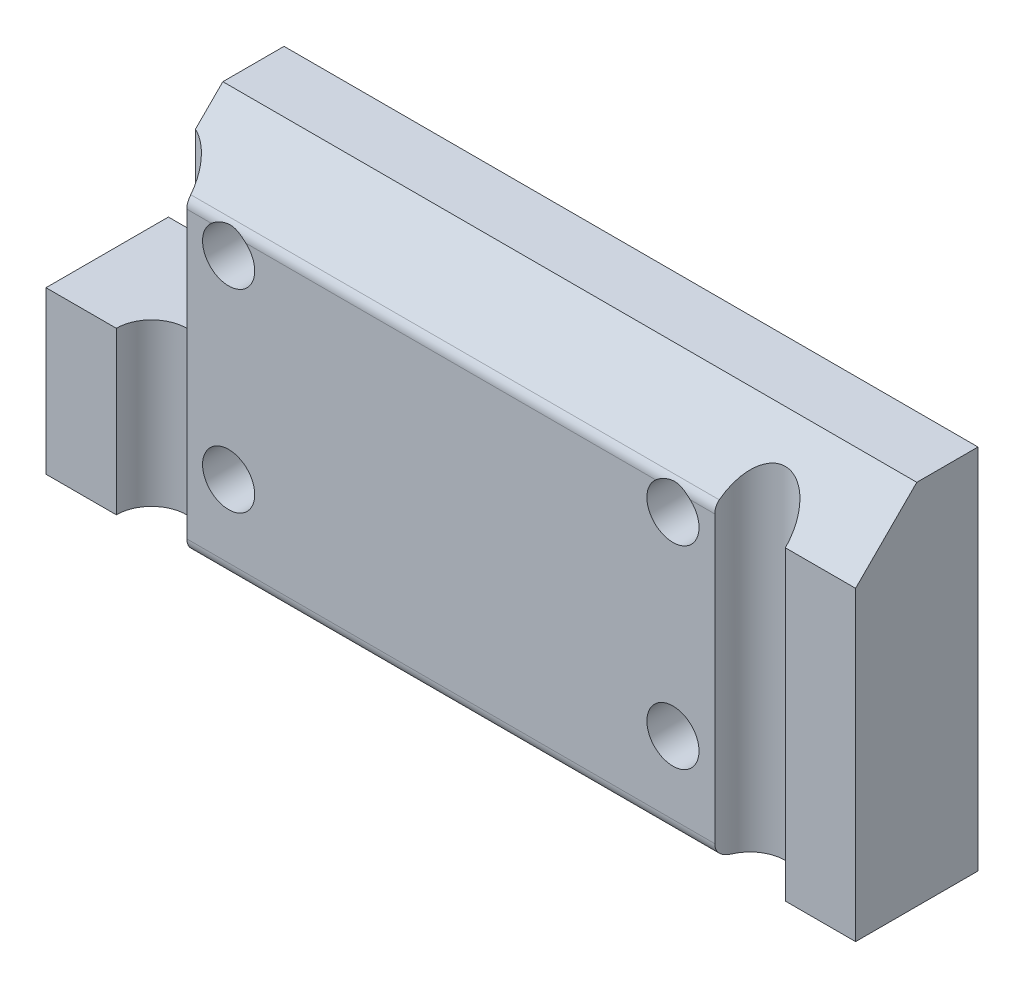
ISO-10303-21;
HEADER;
FILE_DESCRIPTION(('STEP AP214'),'2;1');
FILE_NAME('part.step','',(''),(''),'','','');
FILE_SCHEMA(('AUTOMOTIVE_DESIGN { 1 0 10303 214 1 1 1 1 }'));
ENDSEC;
DATA;
#1=APPLICATION_CONTEXT('core data for automotive mechanical design processes');
#2=APPLICATION_PROTOCOL_DEFINITION('international standard','automotive_design',2000,#1);
#3=PRODUCT_CONTEXT('',#1,'mechanical');
#4=PRODUCT('Part','Part','',(#3));
#5=PRODUCT_RELATED_PRODUCT_CATEGORY('part','',(#4));
#6=PRODUCT_DEFINITION_FORMATION('','',#4);
#7=PRODUCT_DEFINITION_CONTEXT('part definition',#1,'design');
#8=PRODUCT_DEFINITION('design','',#6,#7);
#9=PRODUCT_DEFINITION_SHAPE('','',#8);
#10=(LENGTH_UNIT() NAMED_UNIT(*) SI_UNIT(.MILLI.,.METRE.));
#11=(NAMED_UNIT(*) PLANE_ANGLE_UNIT() SI_UNIT($,.RADIAN.));
#12=(NAMED_UNIT(*) SI_UNIT($,.STERADIAN.) SOLID_ANGLE_UNIT());
#13=UNCERTAINTY_MEASURE_WITH_UNIT(LENGTH_MEASURE(1.E-05),#10,'distance_accuracy_value','');
#14=(GEOMETRIC_REPRESENTATION_CONTEXT(3) GLOBAL_UNCERTAINTY_ASSIGNED_CONTEXT((#13)) GLOBAL_UNIT_ASSIGNED_CONTEXT((#10,
#11,#12)) REPRESENTATION_CONTEXT('',''));
#15=CARTESIAN_POINT('',(0.,0.,0.));
#16=DIRECTION('',(0.,0.,1.));
#17=DIRECTION('',(1.,0.,0.));
#18=AXIS2_PLACEMENT_3D('',#15,#16,#17);
#19=CARTESIAN_POINT('',(21.,6.34999999999997,0.));
#20=DIRECTION('',(0.,0.,-1.));
#21=DIRECTION('',(0.,1.,0.));
#22=AXIS2_PLACEMENT_3D('',#19,#20,#21);
#23=PLANE('',#22);
#24=DIRECTION('',(-1.,0.,0.));
#25=VECTOR('',#24,1.);
#26=CARTESIAN_POINT('',(21.,6.34999999999997,0.));
#27=LINE('',#26,#25);
#28=CARTESIAN_POINT('',(21.,6.34999999999997,0.));
#29=VERTEX_POINT('',#28);
#30=CARTESIAN_POINT('',(17.3538,6.34999999999997,0.));
#31=VERTEX_POINT('',#30);
#32=EDGE_CURVE('E195',#29,#31,#27,.T.);
#33=ORIENTED_EDGE('',*,*,#32,.T.);
#34=DIRECTION('',(0.,-1.,0.));
#35=VECTOR('',#34,1.);
#36=CARTESIAN_POINT('',(17.3538,-9.525,0.));
#37=LINE('',#36,#35);
#38=CARTESIAN_POINT('',(17.3538,-9.525,0.));
#39=VERTEX_POINT('',#38);
#40=EDGE_CURVE('E220',#31,#39,#37,.T.);
#41=ORIENTED_EDGE('',*,*,#40,.T.);
#42=DIRECTION('',(-1.,0.,0.));
#43=VECTOR('',#42,1.);
#44=CARTESIAN_POINT('',(21.,-9.525,0.));
#45=LINE('',#44,#43);
#46=CARTESIAN_POINT('',(21.,-9.525,0.));
#47=VERTEX_POINT('',#46);
#48=EDGE_CURVE('E192',#47,#39,#45,.T.);
#49=ORIENTED_EDGE('',*,*,#48,.F.);
#50=DIRECTION('',(0.,-1.,0.));
#51=VECTOR('',#50,1.);
#52=CARTESIAN_POINT('',(21.,6.34999999999997,0.));
#53=LINE('',#52,#51);
#54=EDGE_CURVE('E300',#29,#47,#53,.T.);
#55=ORIENTED_EDGE('',*,*,#54,.F.);
#56=EDGE_LOOP('',(#33,#41,#49,#55));
#57=FACE_BOUND('',#56,.T.);
#58=ADVANCED_FACE('F45',(#57),#23,.F.);
#59=CARTESIAN_POINT('',(-11.525,-5.025,0.));
#60=DIRECTION('',(0.,0.,-1.));
#61=DIRECTION('',(0.,1.,0.));
#62=AXIS2_PLACEMENT_3D('',#59,#60,#61);
#63=CIRCLE('',#62,1.35255);
#64=CARTESIAN_POINT('',(-11.525,-3.67245,0.));
#65=VERTEX_POINT('',#64);
#66=EDGE_CURVE('E177',#65,#65,#63,.T.);
#67=ORIENTED_EDGE('',*,*,#66,.T.);
#68=EDGE_LOOP('',(#67));
#69=FACE_BOUND('',#68,.T.);
#70=CARTESIAN_POINT('',(11.525,-5.025,0.));
#71=DIRECTION('',(0.,0.,-1.));
#72=DIRECTION('',(0.,1.,0.));
#73=AXIS2_PLACEMENT_3D('',#70,#71,#72);
#74=CIRCLE('',#73,1.35255);
#75=CARTESIAN_POINT('',(11.525,-3.67245,0.));
#76=VERTEX_POINT('',#75);
#77=EDGE_CURVE('E208',#76,#76,#74,.T.);
#78=ORIENTED_EDGE('',*,*,#77,.T.);
#79=EDGE_LOOP('',(#78));
#80=FACE_BOUND('',#79,.T.);
#81=CARTESIAN_POINT('',(11.525,5.025,0.));
#82=DIRECTION('',(0.,0.,-1.));
#83=DIRECTION('',(0.,1.,0.));
#84=AXIS2_PLACEMENT_3D('',#81,#82,#83);
#85=CIRCLE('',#84,1.35255);
#86=CARTESIAN_POINT('',(12.4197101292521,6.03933982822015,0.));
#87=VERTEX_POINT('',#86);
#88=CARTESIAN_POINT('',(10.6302898707479,6.03933982822015,0.));
#89=VERTEX_POINT('',#88);
#90=EDGE_CURVE('E207',#87,#89,#85,.T.);
#91=ORIENTED_EDGE('',*,*,#90,.T.);
#92=DIRECTION('',(-1.,0.,0.));
#93=VECTOR('',#92,1.);
#94=CARTESIAN_POINT('',(21.,6.03933982822015,0.));
#95=LINE('',#94,#93);
#96=CARTESIAN_POINT('',(-10.6302898707479,6.03933982822015,0.));
#97=VERTEX_POINT('',#96);
#98=EDGE_CURVE('E229',#89,#97,#95,.T.);
#99=ORIENTED_EDGE('',*,*,#98,.T.);
#100=CARTESIAN_POINT('',(-11.525,5.025,0.));
#101=DIRECTION('',(0.,0.,-1.));
#102=DIRECTION('',(0.,1.,0.));
#103=AXIS2_PLACEMENT_3D('',#100,#101,#102);
#104=CIRCLE('',#103,1.35255);
#105=CARTESIAN_POINT('',(-12.4197101292521,6.03933982822015,0.));
#106=VERTEX_POINT('',#105);
#107=EDGE_CURVE('E204',#97,#106,#104,.T.);
#108=ORIENTED_EDGE('',*,*,#107,.T.);
#109=DIRECTION('',(-1.,0.,0.));
#110=VECTOR('',#109,1.);
#111=CARTESIAN_POINT('',(-13.0579550646261,6.03933982822015,0.));
#112=LINE('',#111,#110);
#113=CARTESIAN_POINT('',(-13.6962,6.03933982822015,0.));
#114=VERTEX_POINT('',#113);
#115=EDGE_CURVE('E227',#106,#114,#112,.T.);
#116=ORIENTED_EDGE('',*,*,#115,.T.);
#117=DIRECTION('',(0.,-1.,0.));
#118=VECTOR('',#117,1.);
#119=CARTESIAN_POINT('',(-13.6962,-9.525,0.));
#120=LINE('',#119,#118);
#121=CARTESIAN_POINT('',(-13.6962,-8.775,0.));
#122=VERTEX_POINT('',#121);
#123=EDGE_CURVE('E324',#114,#122,#120,.T.);
#124=ORIENTED_EDGE('',*,*,#123,.T.);
#125=DIRECTION('',(-1.,0.,0.));
#126=VECTOR('',#125,1.);
#127=CARTESIAN_POINT('',(21.,-8.775,0.));
#128=LINE('',#127,#126);
#129=CARTESIAN_POINT('',(13.6962,-8.775,0.));
#130=VERTEX_POINT('',#129);
#131=EDGE_CURVE('E223',#122,#130,#128,.F.);
#132=ORIENTED_EDGE('',*,*,#131,.T.);
#133=DIRECTION('',(0.,-1.,0.));
#134=VECTOR('',#133,1.);
#135=CARTESIAN_POINT('',(13.6962,-9.525,0.));
#136=LINE('',#135,#134);
#137=CARTESIAN_POINT('',(13.6962,6.03933982822015,0.));
#138=VERTEX_POINT('',#137);
#139=EDGE_CURVE('E217',#130,#138,#136,.F.);
#140=ORIENTED_EDGE('',*,*,#139,.T.);
#141=DIRECTION('',(-1.,0.,0.));
#142=VECTOR('',#141,1.);
#143=CARTESIAN_POINT('',(13.0579550646261,6.03933982822015,0.));
#144=LINE('',#143,#142);
#145=EDGE_CURVE('E225',#138,#87,#144,.T.);
#146=ORIENTED_EDGE('',*,*,#145,.T.);
#147=EDGE_LOOP('',(#91,#99,#108,#116,#124,#132,#140,#146));
#148=FACE_BOUND('',#147,.T.);
#149=ADVANCED_FACE('F276',(#69,#80,#148),#23,.F.);
#150=CARTESIAN_POINT('',(21.,9.525,-6.35));
#151=DIRECTION('',(0.,0.,1.));
#152=DIRECTION('',(1.,0.,0.));
#153=AXIS2_PLACEMENT_3D('',#150,#151,#152);
#154=PLANE('',#153);
#155=CARTESIAN_POINT('',(11.525,5.025,-6.35));
#156=DIRECTION('',(0.,0.,-1.));
#157=DIRECTION('',(-1.,0.,0.));
#158=AXIS2_PLACEMENT_3D('',#155,#156,#157);
#159=CIRCLE('',#158,1.35255);
#160=CARTESIAN_POINT('',(10.17245,5.025,-6.35));
#161=VERTEX_POINT('',#160);
#162=EDGE_CURVE('E327',#161,#161,#159,.T.);
#163=ORIENTED_EDGE('',*,*,#162,.F.);
#164=EDGE_LOOP('',(#163));
#165=FACE_BOUND('',#164,.T.);
#166=CARTESIAN_POINT('',(11.525,-5.025,-6.35));
#167=DIRECTION('',(0.,0.,-1.));
#168=DIRECTION('',(-1.,0.,0.));
#169=AXIS2_PLACEMENT_3D('',#166,#167,#168);
#170=CIRCLE('',#169,1.35255);
#171=CARTESIAN_POINT('',(10.17245,-5.025,-6.35));
#172=VERTEX_POINT('',#171);
#173=EDGE_CURVE('E212',#172,#172,#170,.T.);
#174=ORIENTED_EDGE('',*,*,#173,.F.);
#175=EDGE_LOOP('',(#174));
#176=FACE_BOUND('',#175,.T.);
#177=CARTESIAN_POINT('',(-11.525,5.025,-6.35));
#178=DIRECTION('',(0.,0.,-1.));
#179=DIRECTION('',(-1.,0.,0.));
#180=AXIS2_PLACEMENT_3D('',#177,#178,#179);
#181=CIRCLE('',#180,1.35255);
#182=CARTESIAN_POINT('',(-12.87755,5.025,-6.35));
#183=VERTEX_POINT('',#182);
#184=EDGE_CURVE('E211',#183,#183,#181,.T.);
#185=ORIENTED_EDGE('',*,*,#184,.F.);
#186=EDGE_LOOP('',(#185));
#187=FACE_BOUND('',#186,.T.);
#188=CARTESIAN_POINT('',(-11.525,-5.025,-6.35));
#189=DIRECTION('',(0.,0.,-1.));
#190=DIRECTION('',(-1.,0.,0.));
#191=AXIS2_PLACEMENT_3D('',#188,#189,#190);
#192=CIRCLE('',#191,1.35255);
#193=CARTESIAN_POINT('',(-12.87755,-5.025,-6.35));
#194=VERTEX_POINT('',#193);
#195=EDGE_CURVE('E182',#194,#194,#192,.T.);
#196=ORIENTED_EDGE('',*,*,#195,.F.);
#197=EDGE_LOOP('',(#196));
#198=FACE_BOUND('',#197,.T.);
#199=DIRECTION('',(1.,0.,0.));
#200=VECTOR('',#199,1.);
#201=CARTESIAN_POINT('',(-21.,-1.143,-6.35));
#202=LINE('',#201,#200);
#203=CARTESIAN_POINT('',(-21.,-1.143,-6.35));
#204=VERTEX_POINT('',#203);
#205=CARTESIAN_POINT('',(-15.,-1.143,-6.35));
#206=VERTEX_POINT('',#205);
#207=EDGE_CURVE('E152',#204,#206,#202,.T.);
#208=ORIENTED_EDGE('',*,*,#207,.T.);
#209=DIRECTION('',(0.,1.,0.));
#210=VECTOR('',#209,1.);
#211=CARTESIAN_POINT('',(-15.,9.525,-6.35));
#212=LINE('',#211,#210);
#213=CARTESIAN_POINT('',(-15.,9.525,-6.35));
#214=VERTEX_POINT('',#213);
#215=EDGE_CURVE('E162',#206,#214,#212,.T.);
#216=ORIENTED_EDGE('',*,*,#215,.T.);
#217=DIRECTION('',(-1.,0.,0.));
#218=VECTOR('',#217,1.);
#219=CARTESIAN_POINT('',(21.,9.525,-6.35));
#220=LINE('',#219,#218);
#221=CARTESIAN_POINT('',(21.,9.525,-6.35));
#222=VERTEX_POINT('',#221);
#223=EDGE_CURVE('E201',#222,#214,#220,.T.);
#224=ORIENTED_EDGE('',*,*,#223,.F.);
#225=DIRECTION('',(0.,1.,0.));
#226=VECTOR('',#225,1.);
#227=CARTESIAN_POINT('',(21.,9.525,-6.35));
#228=LINE('',#227,#226);
#229=CARTESIAN_POINT('',(21.,-9.525,-6.35));
#230=VERTEX_POINT('',#229);
#231=EDGE_CURVE('E189',#230,#222,#228,.T.);
#232=ORIENTED_EDGE('',*,*,#231,.F.);
#233=DIRECTION('',(-1.,0.,0.));
#234=VECTOR('',#233,1.);
#235=CARTESIAN_POINT('',(21.,-9.525,-6.35));
#236=LINE('',#235,#234);
#237=CARTESIAN_POINT('',(-21.,-9.525,-6.35));
#238=VERTEX_POINT('',#237);
#239=EDGE_CURVE('E176',#230,#238,#236,.T.);
#240=ORIENTED_EDGE('',*,*,#239,.T.);
#241=DIRECTION('',(0.,1.,0.));
#242=VECTOR('',#241,1.);
#243=CARTESIAN_POINT('',(-21.,9.525,-6.35));
#244=LINE('',#243,#242);
#245=EDGE_CURVE('E169',#238,#204,#244,.T.);
#246=ORIENTED_EDGE('',*,*,#245,.T.);
#247=EDGE_LOOP('',(#208,#216,#224,#232,#240,#246));
#248=FACE_BOUND('',#247,.T.);
#249=ADVANCED_FACE('F173',(#165,#176,#187,#198,#248),#154,.F.);
#250=CARTESIAN_POINT('',(21.,9.525,-3.175));
#251=DIRECTION('',(0.,-1.,0.));
#252=DIRECTION('',(0.,0.,-1.));
#253=AXIS2_PLACEMENT_3D('',#250,#251,#252);
#254=PLANE('',#253);
#255=ORIENTED_EDGE('',*,*,#223,.T.);
#256=DIRECTION('',(0.,0.,1.));
#257=VECTOR('',#256,1.);
#258=CARTESIAN_POINT('',(-15.,9.525,-6.35));
#259=LINE('',#258,#257);
#260=CARTESIAN_POINT('',(-15.,9.525,-3.175));
#261=VERTEX_POINT('',#260);
#262=EDGE_CURVE('E317',#214,#261,#259,.T.);
#263=ORIENTED_EDGE('',*,*,#262,.T.);
#264=DIRECTION('',(-1.,0.,0.));
#265=VECTOR('',#264,1.);
#266=CARTESIAN_POINT('',(21.,9.525,-3.175));
#267=LINE('',#266,#265);
#268=CARTESIAN_POINT('',(21.,9.525,-3.175));
#269=VERTEX_POINT('',#268);
#270=EDGE_CURVE('E198',#269,#261,#267,.T.);
#271=ORIENTED_EDGE('',*,*,#270,.F.);
#272=DIRECTION('',(0.,0.,1.));
#273=VECTOR('',#272,1.);
#274=CARTESIAN_POINT('',(21.,9.525,-3.175));
#275=LINE('',#274,#273);
#276=EDGE_CURVE('E338',#222,#269,#275,.T.);
#277=ORIENTED_EDGE('',*,*,#276,.F.);
#278=EDGE_LOOP('',(#255,#263,#271,#277));
#279=FACE_BOUND('',#278,.T.);
#280=ADVANCED_FACE('F279',(#279),#254,.F.);
#281=CARTESIAN_POINT('',(21.,6.34999999999997,0.));
#282=DIRECTION('',(0.,-0.707106781186544,-0.707106781186551));
#283=DIRECTION('',(0.,0.707106781186551,-0.707106781186544));
#284=AXIS2_PLACEMENT_3D('',#281,#282,#283);
#285=PLANE('',#284);
#286=ORIENTED_EDGE('',*,*,#270,.T.);
#287=DIRECTION('',(0.,-0.707106781186551,0.707106781186544));
#288=VECTOR('',#287,1.);
#289=CARTESIAN_POINT('',(-15.,6.34999999999996,0.));
#290=LINE('',#289,#288);
#291=CARTESIAN_POINT('',(-15.,8.10182317600833,-1.75182317600835));
#292=VERTEX_POINT('',#291);
#293=EDGE_CURVE('E314',#261,#292,#290,.T.);
#294=ORIENTED_EDGE('',*,*,#293,.T.);
#295=CARTESIAN_POINT('',(-15.525,6.34999999999997,0.));
#296=DIRECTION('',(0.,-0.707106781186544,-0.707106781186551));
#297=DIRECTION('',(0.,-0.707106781186551,0.707106781186544));
#298=AXIS2_PLACEMENT_3D('',#295,#296,#297);
#299=ELLIPSE('',#298,2.58631376286792,1.82879999999999);
#300=CARTESIAN_POINT('',(-13.7094409762184,6.56966991411005,-0.219669914110086));
#301=VERTEX_POINT('',#300);
#302=EDGE_CURVE('E322',#292,#301,#299,.T.);
#303=ORIENTED_EDGE('',*,*,#302,.T.);
#304=DIRECTION('',(-1.,0.,0.));
#305=VECTOR('',#304,1.);
#306=CARTESIAN_POINT('',(21.,6.56966991411005,-0.219669914110086));
#307=LINE('',#306,#305);
#308=CARTESIAN_POINT('',(13.7094409762184,6.56966991411005,-0.219669914110086));
#309=VERTEX_POINT('',#308);
#310=EDGE_CURVE('E306',#301,#309,#307,.F.);
#311=ORIENTED_EDGE('',*,*,#310,.T.);
#312=CARTESIAN_POINT('',(15.525,6.34999999999997,0.));
#313=DIRECTION('',(0.,-0.707106781186544,-0.707106781186551));
#314=DIRECTION('',(0.,-0.707106781186551,0.707106781186544));
#315=AXIS2_PLACEMENT_3D('',#312,#313,#314);
#316=ELLIPSE('',#315,2.58631376286792,1.82879999999999);
#317=EDGE_CURVE('E304',#309,#31,#316,.T.);
#318=ORIENTED_EDGE('',*,*,#317,.T.);
#319=ORIENTED_EDGE('',*,*,#32,.F.);
#320=DIRECTION('',(0.,-0.707106781186551,0.707106781186544));
#321=VECTOR('',#320,1.);
#322=CARTESIAN_POINT('',(21.,6.34999999999997,0.));
#323=LINE('',#322,#321);
#324=EDGE_CURVE('E302',#269,#29,#323,.T.);
#325=ORIENTED_EDGE('',*,*,#324,.F.);
#326=EDGE_LOOP('',(#286,#294,#303,#311,#318,#319,#325));
#327=FACE_BOUND('',#326,.T.);
#328=ADVANCED_FACE('F274',(#327),#285,.F.);
#329=DIRECTION('',(0.,-1.,0.));
#330=VECTOR('',#329,1.);
#331=CARTESIAN_POINT('',(-17.3538,-9.525,0.));
#332=LINE('',#331,#330);
#333=CARTESIAN_POINT('',(-17.3538,-9.525,0.));
#334=VERTEX_POINT('',#333);
#335=CARTESIAN_POINT('',(-17.3538,-1.143,0.));
#336=VERTEX_POINT('',#335);
#337=EDGE_CURVE('E308',#334,#336,#332,.F.);
#338=ORIENTED_EDGE('',*,*,#337,.T.);
#339=DIRECTION('',(1.,0.,0.));
#340=VECTOR('',#339,1.);
#341=CARTESIAN_POINT('',(-21.,-1.143,0.));
#342=LINE('',#341,#340);
#343=CARTESIAN_POINT('',(-21.,-1.143,0.));
#344=VERTEX_POINT('',#343);
#345=EDGE_CURVE('E61',#344,#336,#342,.T.);
#346=ORIENTED_EDGE('',*,*,#345,.F.);
#347=DIRECTION('',(0.,-1.,0.));
#348=VECTOR('',#347,1.);
#349=CARTESIAN_POINT('',(-21.,6.34999999999997,0.));
#350=LINE('',#349,#348);
#351=CARTESIAN_POINT('',(-21.,-9.525,0.));
#352=VERTEX_POINT('',#351);
#353=EDGE_CURVE('E170',#344,#352,#350,.T.);
#354=ORIENTED_EDGE('',*,*,#353,.T.);
#355=EDGE_CURVE('E191',#334,#352,#45,.T.);
#356=ORIENTED_EDGE('',*,*,#355,.F.);
#357=EDGE_LOOP('',(#338,#346,#354,#356));
#358=FACE_BOUND('',#357,.T.);
#359=ADVANCED_FACE('F270',(#358),#23,.F.);
#360=CARTESIAN_POINT('',(21.,-9.525,0.));
#361=DIRECTION('',(0.,1.,0.));
#362=DIRECTION('',(0.,0.,1.));
#363=AXIS2_PLACEMENT_3D('',#360,#361,#362);
#364=PLANE('',#363);
#365=CARTESIAN_POINT('',(15.525,-9.525,0.));
#366=DIRECTION('',(0.,-1.,0.));
#367=DIRECTION('',(0.,0.,-1.));
#368=AXIS2_PLACEMENT_3D('',#365,#366,#367);
#369=CIRCLE('',#368,1.82879999999999);
#370=CARTESIAN_POINT('',(13.8570643177868,-9.525,-0.750000000000002));
#371=VERTEX_POINT('',#370);
#372=EDGE_CURVE('E309',#371,#39,#369,.T.);
#373=ORIENTED_EDGE('',*,*,#372,.F.);
#374=DIRECTION('',(-1.,0.,0.));
#375=VECTOR('',#374,1.);
#376=CARTESIAN_POINT('',(21.,-9.525,-0.750000000000002));
#377=LINE('',#376,#375);
#378=CARTESIAN_POINT('',(-13.8570643177868,-9.525,-0.750000000000002));
#379=VERTEX_POINT('',#378);
#380=EDGE_CURVE('E392',#371,#379,#377,.T.);
#381=ORIENTED_EDGE('',*,*,#380,.T.);
#382=CARTESIAN_POINT('',(-15.525,-9.525,0.));
#383=DIRECTION('',(0.,1.,0.));
#384=DIRECTION('',(0.,0.,1.));
#385=AXIS2_PLACEMENT_3D('',#382,#383,#384);
#386=CIRCLE('',#385,1.82879999999999);
#387=EDGE_CURVE('E215',#379,#334,#386,.T.);
#388=ORIENTED_EDGE('',*,*,#387,.T.);
#389=ORIENTED_EDGE('',*,*,#355,.T.);
#390=DIRECTION('',(0.,0.,-1.));
#391=VECTOR('',#390,1.);
#392=CARTESIAN_POINT('',(-21.,-9.525,0.));
#393=LINE('',#392,#391);
#394=EDGE_CURVE('E179',#352,#238,#393,.T.);
#395=ORIENTED_EDGE('',*,*,#394,.T.);
#396=ORIENTED_EDGE('',*,*,#239,.F.);
#397=DIRECTION('',(0.,0.,-1.));
#398=VECTOR('',#397,1.);
#399=CARTESIAN_POINT('',(21.,-9.525,0.));
#400=LINE('',#399,#398);
#401=EDGE_CURVE('E185',#47,#230,#400,.T.);
#402=ORIENTED_EDGE('',*,*,#401,.F.);
#403=ORIENTED_EDGE('',*,*,#48,.T.);
#404=EDGE_LOOP('',(#373,#381,#388,#389,#395,#396,#402,#403));
#405=FACE_BOUND('',#404,.T.);
#406=ADVANCED_FACE('F264',(#405),#364,.F.);
#407=CARTESIAN_POINT('',(21.,0.,0.));
#408=DIRECTION('',(1.,0.,0.));
#409=DIRECTION('',(0.,0.,-1.));
#410=AXIS2_PLACEMENT_3D('',#407,#408,#409);
#411=PLANE('',#410);
#412=ORIENTED_EDGE('',*,*,#231,.T.);
#413=ORIENTED_EDGE('',*,*,#276,.T.);
#414=ORIENTED_EDGE('',*,*,#324,.T.);
#415=ORIENTED_EDGE('',*,*,#54,.T.);
#416=ORIENTED_EDGE('',*,*,#401,.T.);
#417=EDGE_LOOP('',(#412,#413,#414,#415,#416));
#418=FACE_BOUND('',#417,.T.);
#419=ADVANCED_FACE('F261',(#418),#411,.T.);
#420=CARTESIAN_POINT('',(-21.,0.,0.));
#421=DIRECTION('',(1.,0.,0.));
#422=DIRECTION('',(0.,0.,-1.));
#423=AXIS2_PLACEMENT_3D('',#420,#421,#422);
#424=PLANE('',#423);
#425=ORIENTED_EDGE('',*,*,#353,.F.);
#426=DIRECTION('',(0.,0.,1.));
#427=VECTOR('',#426,1.);
#428=CARTESIAN_POINT('',(-21.,-1.143,-6.35));
#429=LINE('',#428,#427);
#430=EDGE_CURVE('E155',#204,#344,#429,.T.);
#431=ORIENTED_EDGE('',*,*,#430,.F.);
#432=ORIENTED_EDGE('',*,*,#245,.F.);
#433=ORIENTED_EDGE('',*,*,#394,.F.);
#434=EDGE_LOOP('',(#425,#431,#432,#433));
#435=FACE_BOUND('',#434,.T.);
#436=ADVANCED_FACE('F167',(#435),#424,.F.);
#437=CARTESIAN_POINT('',(-11.525,-5.025,-6.35));
#438=DIRECTION('',(0.,0.,-1.));
#439=DIRECTION('',(-1.,0.,0.));
#440=AXIS2_PLACEMENT_3D('',#437,#438,#439);
#441=CYLINDRICAL_SURFACE('',#440,1.35255);
#442=ORIENTED_EDGE('',*,*,#195,.T.);
#443=EDGE_LOOP('',(#442));
#444=FACE_BOUND('',#443,.T.);
#445=ORIENTED_EDGE('',*,*,#66,.F.);
#446=EDGE_LOOP('',(#445));
#447=FACE_BOUND('',#446,.T.);
#448=ADVANCED_FACE('F255',(#444,#447),#441,.F.);
#449=CARTESIAN_POINT('',(-11.525,5.025,-6.35));
#450=DIRECTION('',(0.,0.,-1.));
#451=DIRECTION('',(-1.,0.,0.));
#452=AXIS2_PLACEMENT_3D('',#449,#450,#451);
#453=CYLINDRICAL_SURFACE('',#452,1.35255);
#454=ORIENTED_EDGE('',*,*,#184,.T.);
#455=EDGE_LOOP('',(#454));
#456=FACE_BOUND('',#455,.T.);
#457=ORIENTED_EDGE('',*,*,#107,.F.);
#458=CARTESIAN_POINT('',(-10.6302898707479,6.03933982822015,0.));
#459=CARTESIAN_POINT('',(-10.6541537056567,6.06039156132562,-3.79900557424061E-06));
#460=CARTESIAN_POINT('',(-10.6787404479971,6.08057852292136,-0.000885576114171746));
#461=CARTESIAN_POINT('',(-10.7291925365121,6.11911492735218,-0.00400383935589411));
#462=CARTESIAN_POINT('',(-10.75505641776,6.13746640563877,-0.00623880502486885));
#463=CARTESIAN_POINT('',(-10.8343748845607,6.18965986253408,-0.014374391470955));
#464=CARTESIAN_POINT('',(-10.8895758939129,6.22065809186072,-0.0217063539007951));
#465=CARTESIAN_POINT('',(-11.0089425955445,6.27713533590166,-0.0380330227697951));
#466=CARTESIAN_POINT('',(-11.0734639894052,6.30182801772388,-0.04711907964616));
#467=CARTESIAN_POINT('',(-11.2057970877973,6.34114856250529,-0.0630719510288862));
#468=CARTESIAN_POINT('',(-11.2736066075748,6.35578301303189,-0.0699402164960301));
#469=CARTESIAN_POINT('',(-11.3796070766201,6.37024304125517,-0.0769250071011146));
#470=CARTESIAN_POINT('',(-11.4172149858844,6.37377793773495,-0.0786919997531241));
#471=CARTESIAN_POINT('',(-11.4926458733401,6.37768963214574,-0.080652777871197));
#472=CARTESIAN_POINT('',(-11.5304688580407,6.37806633397899,-0.0808465154661454));
#473=CARTESIAN_POINT('',(-11.6060038837106,6.37565119481226,-0.0796297368150377));
#474=CARTESIAN_POINT('',(-11.6437158649557,6.37285788128981,-0.0782184750206278));
#475=CARTESIAN_POINT('',(-11.7186998479527,6.36414089682362,-0.0739625698759834));
#476=CARTESIAN_POINT('',(-11.7559716660109,6.35821596308877,-0.0711173483189038));
#477=CARTESIAN_POINT('',(-11.8601396591811,6.33716440577297,-0.0615013524912137));
#478=CARTESIAN_POINT('',(-11.9262219995787,6.31847705589952,-0.0534257958702264));
#479=CARTESIAN_POINT('',(-12.0546130772475,6.27142689063229,-0.0363792748922068));
#480=CARTESIAN_POINT('',(-12.1169254038242,6.24307345427973,-0.027409184451608));
#481=CARTESIAN_POINT('',(-12.2201340555991,6.18629829948982,-0.0141317810912577));
#482=CARTESIAN_POINT('',(-12.2621686260268,6.16008642029229,-0.00922145208724687));
#483=CARTESIAN_POINT('',(-12.3432880485249,6.10308337837738,-0.00216732392117172));
#484=CARTESIAN_POINT('',(-12.3823706724265,6.07228880764258,-2.55952694219371E-05));
#485=CARTESIAN_POINT('',(-12.4197101292521,6.03933982822015,0.));
#486=B_SPLINE_CURVE_WITH_KNOTS('',3,(#458,#459,#460,#461,#462,#463,#464,#465,#466,#467,#468,
#469,#470,#471,#472,#473,#474,#475,#476,#477,#478,#479,#480,#481,#482,#483,#484,#485),
.UNSPECIFIED.,.F.,.F.,(4,2,2,2,2,2,2,2,2,2,2,2,2,4),(0.,0.0953871282273528,0.19066727635137,
0.381150131945865,0.589431215503299,0.797575756514314,0.910877051988526,1.02418179498956,
1.1375391913937,1.25094233282264,1.45749503704072,1.66384789011924,1.81283999594309,
1.961943461849),.UNSPECIFIED.);
#487=EDGE_CURVE('E232',#97,#106,#486,.T.);
#488=ORIENTED_EDGE('',*,*,#487,.T.);
#489=EDGE_LOOP('',(#457,#488));
#490=FACE_BOUND('',#489,.T.);
#491=ADVANCED_FACE('F249',(#456,#490),#453,.F.);
#492=CARTESIAN_POINT('',(11.525,-5.025,-6.35));
#493=DIRECTION('',(0.,0.,-1.));
#494=DIRECTION('',(-1.,0.,0.));
#495=AXIS2_PLACEMENT_3D('',#492,#493,#494);
#496=CYLINDRICAL_SURFACE('',#495,1.35255);
#497=ORIENTED_EDGE('',*,*,#173,.T.);
#498=EDGE_LOOP('',(#497));
#499=FACE_BOUND('',#498,.T.);
#500=ORIENTED_EDGE('',*,*,#77,.F.);
#501=EDGE_LOOP('',(#500));
#502=FACE_BOUND('',#501,.T.);
#503=ADVANCED_FACE('F254',(#499,#502),#496,.F.);
#504=CARTESIAN_POINT('',(11.525,5.025,-6.35));
#505=DIRECTION('',(0.,0.,-1.));
#506=DIRECTION('',(-1.,0.,0.));
#507=AXIS2_PLACEMENT_3D('',#504,#505,#506);
#508=CYLINDRICAL_SURFACE('',#507,1.35255);
#509=ORIENTED_EDGE('',*,*,#162,.T.);
#510=EDGE_LOOP('',(#509));
#511=FACE_BOUND('',#510,.T.);
#512=ORIENTED_EDGE('',*,*,#90,.F.);
#513=CARTESIAN_POINT('',(12.4197101292521,6.03933982822015,0.));
#514=CARTESIAN_POINT('',(12.3958462943433,6.06039156132562,-3.79900557418258E-06));
#515=CARTESIAN_POINT('',(12.3712595520029,6.08057852292136,-0.00088557611417175));
#516=CARTESIAN_POINT('',(12.3208074634879,6.11911492735218,-0.00400383935589418));
#517=CARTESIAN_POINT('',(12.29494358224,6.13746640563877,-0.00623880502486893));
#518=CARTESIAN_POINT('',(12.2156251154393,6.18965986253408,-0.0143743914709551));
#519=CARTESIAN_POINT('',(12.1604241060871,6.22065809186072,-0.0217063539007952));
#520=CARTESIAN_POINT('',(12.0410574044555,6.27713533590166,-0.0380330227697951));
#521=CARTESIAN_POINT('',(11.9765360105948,6.30182801772388,-0.04711907964616));
#522=CARTESIAN_POINT('',(11.8442029122027,6.34114856250529,-0.0630719510288862));
#523=CARTESIAN_POINT('',(11.7763933924252,6.35578301303189,-0.0699402164960302));
#524=CARTESIAN_POINT('',(11.6703929233799,6.37024304125517,-0.0769250071011146));
#525=CARTESIAN_POINT('',(11.6327850141156,6.37377793773495,-0.078691999753124));
#526=CARTESIAN_POINT('',(11.5573541266599,6.37768963214574,-0.0806527778711968));
#527=CARTESIAN_POINT('',(11.5195311419593,6.37806633397899,-0.0808465154661453));
#528=CARTESIAN_POINT('',(11.4439961162894,6.37565119481226,-0.0796297368150376));
#529=CARTESIAN_POINT('',(11.4062841350443,6.37285788128981,-0.0782184750206278));
#530=CARTESIAN_POINT('',(11.3313001520473,6.36414089682362,-0.0739625698759835));
#531=CARTESIAN_POINT('',(11.2940283339891,6.35821596308877,-0.0711173483189038));
#532=CARTESIAN_POINT('',(11.1898603408189,6.33716440577297,-0.0615013524912138));
#533=CARTESIAN_POINT('',(11.1237780004213,6.31847705589952,-0.0534257958702265));
#534=CARTESIAN_POINT('',(10.9953869227525,6.27142689063229,-0.0363792748922068));
#535=CARTESIAN_POINT('',(10.9330745961758,6.24307345427973,-0.027409184451608));
#536=CARTESIAN_POINT('',(10.8298659444009,6.18629829948982,-0.0141317810912578));
#537=CARTESIAN_POINT('',(10.7878313739732,6.16008642029229,-0.0092214520872469));
#538=CARTESIAN_POINT('',(10.7067119514751,6.10308337837738,-0.00216732392117171));
#539=CARTESIAN_POINT('',(10.6676293275735,6.07228880764258,-2.55952694219025E-05));
#540=CARTESIAN_POINT('',(10.6302898707479,6.03933982822015,0.));
#541=B_SPLINE_CURVE_WITH_KNOTS('',3,(#513,#514,#515,#516,#517,#518,#519,#520,#521,#522,#523,
#524,#525,#526,#527,#528,#529,#530,#531,#532,#533,#534,#535,#536,#537,#538,#539,#540),
.UNSPECIFIED.,.F.,.F.,(4,2,2,2,2,2,2,2,2,2,2,2,2,4),(0.,0.0953871282273528,0.19066727635137,
0.381150131945865,0.589431215503299,0.797575756514314,0.910877051988524,1.02418179498956,
1.1375391913937,1.25094233282264,1.45749503704072,1.66384789011924,1.81283999594309,
1.961943461849),.UNSPECIFIED.);
#542=EDGE_CURVE('E386',#87,#89,#541,.T.);
#543=ORIENTED_EDGE('',*,*,#542,.T.);
#544=EDGE_LOOP('',(#512,#543));
#545=FACE_BOUND('',#544,.T.);
#546=ADVANCED_FACE('F381',(#511,#545),#508,.F.);
#547=CARTESIAN_POINT('',(-15.525,-9.525,0.));
#548=DIRECTION('',(0.,-1.,0.));
#549=DIRECTION('',(0.,0.,-1.));
#550=AXIS2_PLACEMENT_3D('',#547,#548,#549);
#551=CYLINDRICAL_SURFACE('',#550,1.82879999999999);
#552=ORIENTED_EDGE('',*,*,#302,.F.);
#553=DIRECTION('',(0.,-1.,0.));
#554=VECTOR('',#553,1.);
#555=CARTESIAN_POINT('',(-15.,-9.525,-1.75182317600835));
#556=LINE('',#555,#554);
#557=CARTESIAN_POINT('',(-15.,-1.143,-1.75182317600835));
#558=VERTEX_POINT('',#557);
#559=EDGE_CURVE('E13',#292,#558,#556,.T.);
#560=ORIENTED_EDGE('',*,*,#559,.T.);
#561=CARTESIAN_POINT('',(-15.525,-1.143,0.));
#562=DIRECTION('',(0.,-1.,0.));
#563=DIRECTION('',(1.,0.,0.));
#564=AXIS2_PLACEMENT_3D('',#561,#562,#563);
#565=CIRCLE('',#564,1.82879999999999);
#566=EDGE_CURVE('E54',#558,#336,#565,.F.);
#567=ORIENTED_EDGE('',*,*,#566,.T.);
#568=ORIENTED_EDGE('',*,*,#337,.F.);
#569=ORIENTED_EDGE('',*,*,#387,.F.);
#570=CARTESIAN_POINT('',(-13.8570643177868,-9.525,-0.750000000000002));
#571=CARTESIAN_POINT('',(-13.8484757914149,-9.52499978054684,-0.730903223821869));
#572=CARTESIAN_POINT('',(-13.8402206079931,-9.524269850175,-0.711662931518232));
#573=CARTESIAN_POINT('',(-13.8244089239077,-9.52128972882999,-0.673004737454884));
#574=CARTESIAN_POINT('',(-13.8168527287809,-9.51903887657859,-0.653586762064902));
#575=CARTESIAN_POINT('',(-13.7952970981863,-9.50991689718858,-0.595271027623003));
#576=CARTESIAN_POINT('',(-13.7824038277263,-9.50067644172592,-0.556296301891106));
#577=CARTESIAN_POINT('',(-13.759704458364,-9.47566573043419,-0.479432194547257));
#578=CARTESIAN_POINT('',(-13.7499075502818,-9.45987635053387,-0.441546342013773));
#579=CARTESIAN_POINT('',(-13.7333003594138,-9.42198025898624,-0.368411647436388));
#580=CARTESIAN_POINT('',(-13.726486882815,-9.39988034496455,-0.333160019117083));
#581=CARTESIAN_POINT('',(-13.7156449600322,-9.3509485007312,-0.267944601666152));
#582=CARTESIAN_POINT('',(-13.7115132916888,-9.32434917365368,-0.237822743537997));
#583=CARTESIAN_POINT('',(-13.705074062323,-9.26655053487886,-0.182118092691115));
#584=CARTESIAN_POINT('',(-13.7027674203497,-9.23534891492367,-0.156537591937885));
#585=CARTESIAN_POINT('',(-13.6993838746035,-9.16874394492891,-0.110366419076919));
#586=CARTESIAN_POINT('',(-13.6983246313427,-9.13328790656328,-0.0898505834134276));
#587=CARTESIAN_POINT('',(-13.6969390465685,-9.05950400953451,-0.0548566243607992));
#588=CARTESIAN_POINT('',(-13.6966125716633,-9.02117667487029,-0.040377402467415));
#589=CARTESIAN_POINT('',(-13.696276927403,-8.94833804570401,-0.0194691333392612));
#590=CARTESIAN_POINT('',(-13.6962288945056,-8.91407010255849,-0.0121821223274119));
#591=CARTESIAN_POINT('',(-13.6962003362383,-8.84487154315467,-0.00244136533273937));
#592=CARTESIAN_POINT('',(-13.6962197779887,-8.80994125789716,1.47337736435299E-05));
#593=CARTESIAN_POINT('',(-13.6962,-8.775,0.));
#594=B_SPLINE_CURVE_WITH_KNOTS('',3,(#570,#571,#572,#573,#574,#575,#576,#577,#578,#579,#580,
#581,#582,#583,#584,#585,#586,#587,#588,#589,#590,#591,#592,#593),.UNSPECIFIED.,.F.,.F.,(4,2,2,
2,2,2,2,2,2,2,2,4),(0.,0.0627876176628366,0.125602552194859,0.25118319024959,0.377133158120047,
0.502947962837962,0.623576686695175,0.744266118334464,0.866644463087047,0.989000528483127,
1.09376946061985,1.19848734745481),.UNSPECIFIED.);
#595=EDGE_CURVE('E239',#379,#122,#594,.T.);
#596=ORIENTED_EDGE('',*,*,#595,.T.);
#597=ORIENTED_EDGE('',*,*,#123,.F.);
#598=CARTESIAN_POINT('',(-13.6962,6.03933982822015,0.));
#599=CARTESIAN_POINT('',(-13.6962410949543,6.08142567375489,3.74335642014652E-05));
#600=CARTESIAN_POINT('',(-13.6962006389997,6.12350451581041,-0.00353974618100383));
#601=CARTESIAN_POINT('',(-13.6962608415569,6.20652735726,-0.0176695219551012));
#602=CARTESIAN_POINT('',(-13.6963616677006,6.2474699496784,-0.0282303963157423));
#603=CARTESIAN_POINT('',(-13.697010271815,6.32702733954752,-0.0560842978396043));
#604=CARTESIAN_POINT('',(-13.6975584251843,6.36564015259901,-0.0733829730143379));
#605=CARTESIAN_POINT('',(-13.6996537239773,6.43933198209062,-0.114176831038593));
#606=CARTESIAN_POINT('',(-13.7011985052041,6.47441913502003,-0.137657271702255));
#607=CARTESIAN_POINT('',(-13.7043389689732,6.51815929866598,-0.172566876406407));
#608=CARTESIAN_POINT('',(-13.7052142886503,6.52884213785244,-0.181595757802586));
#609=CARTESIAN_POINT('',(-13.7071687136034,6.54966521117152,-0.200216160220773));
#610=CARTESIAN_POINT('',(-13.7082475979858,6.55980601831219,-0.209807063671287));
#611=CARTESIAN_POINT('',(-13.7094409762183,6.56966991411007,-0.219669914110067));
#612=B_SPLINE_CURVE_WITH_KNOTS('',3,(#598,#599,#600,#601,#602,#603,#604,#605,#606,#607,#608,
#609,#610,#611),.UNSPECIFIED.,.F.,.F.,(4,2,2,2,2,2,4),(0.,0.126097833293394,0.252345409018021,
0.378699041259722,0.504754034532491,0.546780773996063,0.588762168662166),.UNSPECIFIED.);
#613=EDGE_CURVE('E352',#114,#301,#612,.T.);
#614=ORIENTED_EDGE('',*,*,#613,.T.);
#615=EDGE_LOOP('',(#552,#560,#567,#568,#569,#596,#597,#614));
#616=FACE_BOUND('',#615,.T.);
#617=ADVANCED_FACE('F349',(#616),#551,.F.);
#618=CARTESIAN_POINT('',(15.525,-9.525,0.));
#619=DIRECTION('',(0.,-1.,0.));
#620=DIRECTION('',(0.,0.,-1.));
#621=AXIS2_PLACEMENT_3D('',#618,#619,#620);
#622=CYLINDRICAL_SURFACE('',#621,1.82879999999999);
#623=ORIENTED_EDGE('',*,*,#317,.F.);
#624=CARTESIAN_POINT('',(13.7094409762184,6.56966991411005,-0.219669914110086));
#625=CARTESIAN_POINT('',(13.7058916507484,6.54030310617639,-0.190242055096416));
#626=CARTESIAN_POINT('',(13.703345491695,6.50839318993575,-0.163277741635982));
#627=CARTESIAN_POINT('',(13.6996520589965,6.4405011023774,-0.114950395317137));
#628=CARTESIAN_POINT('',(13.6985048705276,6.40451868325095,-0.0935877035758028));
#629=CARTESIAN_POINT('',(13.697002113231,6.32949425158757,-0.0571390490823345));
#630=CARTESIAN_POINT('',(13.696646652545,6.29045182183862,-0.0420539440125237));
#631=CARTESIAN_POINT('',(13.6962562195332,6.21044793817291,-0.0185954371520296));
#632=CARTESIAN_POINT('',(13.6962206793542,6.16949001421575,-0.0102101674033953));
#633=CARTESIAN_POINT('',(13.6962029580837,6.11342158112823,-0.00351906278033382));
#634=CARTESIAN_POINT('',(13.6962011610056,6.09862570414113,-0.00219904598776701));
#635=CARTESIAN_POINT('',(13.6961997906057,6.06900189325822,-0.000440521154000315));
#636=CARTESIAN_POINT('',(13.6962002142529,6.05417403065036,-8.12770549167442E-07));
#637=CARTESIAN_POINT('',(13.6962,6.03933982822015,0.));
#638=B_SPLINE_CURVE_WITH_KNOTS('',3,(#624,#625,#626,#627,#628,#629,#630,#631,#632,#633,#634,
#635,#636,#637),.UNSPECIFIED.,.F.,.F.,(4,2,2,2,2,2,4),(0.,0.124977526659571,0.249962662200135,
0.37496486837317,0.499745154098815,0.544289356929741,0.588772780147423),.UNSPECIFIED.);
#639=EDGE_CURVE('E356',#309,#138,#638,.T.);
#640=ORIENTED_EDGE('',*,*,#639,.T.);
#641=ORIENTED_EDGE('',*,*,#139,.F.);
#642=CARTESIAN_POINT('',(13.6962,-8.775,0.));
#643=CARTESIAN_POINT('',(13.6962413602921,-8.81712307189178,3.57492666360997E-05));
#644=CARTESIAN_POINT('',(13.6962007049956,-8.8592361918026,-0.00354659354676872));
#645=CARTESIAN_POINT('',(13.6962609308741,-8.94225515125614,-0.0176863122732655));
#646=CARTESIAN_POINT('',(13.6963617437148,-8.98316156393953,-0.028240319314273));
#647=CARTESIAN_POINT('',(13.6970101089778,-9.06264540653163,-0.0560706424708337));
#648=CARTESIAN_POINT('',(13.6975579170661,-9.10122149000649,-0.0733508027563457));
#649=CARTESIAN_POINT('',(13.6996496001298,-9.17490787411818,-0.114118760626706));
#650=CARTESIAN_POINT('',(13.701193315286,-9.21001872979867,-0.137605561837792));
#651=CARTESIAN_POINT('',(13.7058977474568,-9.27551840364789,-0.189888421957009));
#652=CARTESIAN_POINT('',(13.7090471498371,-9.30593834896038,-0.218646440497118));
#653=CARTESIAN_POINT('',(13.7175882754997,-9.36143904095492,-0.280619943641882));
#654=CARTESIAN_POINT('',(13.722978918805,-9.38652235038989,-0.313833276169689));
#655=CARTESIAN_POINT('',(13.7363262416307,-9.43004828859702,-0.382549821178694));
#656=CARTESIAN_POINT('',(13.7442064068879,-9.44865799176022,-0.417962241968952));
#657=CARTESIAN_POINT('',(13.7628512892467,-9.47984643279411,-0.490661773826409));
#658=CARTESIAN_POINT('',(13.7736174981045,-9.49242204231966,-0.527949846272065));
#659=CARTESIAN_POINT('',(13.7958480083677,-9.50977299145325,-0.596313785095445));
#660=CARTESIAN_POINT('',(13.8068374115828,-9.51554522767573,-0.627299058386808));
#661=CARTESIAN_POINT('',(13.8306237730596,-9.52316234046035,-0.688989864063825));
#662=CARTESIAN_POINT('',(13.8434170835234,-9.52501502488732,-0.719695831040694));
#663=CARTESIAN_POINT('',(13.8570643177868,-9.525,-0.750000000000004));
#664=B_SPLINE_CURVE_WITH_KNOTS('',3,(#642,#643,#644,#645,#646,#647,#648,#649,#650,#651,#652,
#653,#654,#655,#656,#657,#658,#659,#660,#661,#662,#663),.UNSPECIFIED.,.F.,.F.,(4,2,2,2,2,2,2,2,
2,2,4),(0.,0.126203174693557,0.252345409613486,0.378559844178763,0.504754029395284,
0.630071018228594,0.755327690971253,0.877058009637733,0.99885137076043,1.09871084240173,
1.19837120294513),.UNSPECIFIED.);
#665=EDGE_CURVE('E69',#130,#371,#664,.T.);
#666=ORIENTED_EDGE('',*,*,#665,.T.);
#667=ORIENTED_EDGE('',*,*,#372,.T.);
#668=ORIENTED_EDGE('',*,*,#40,.F.);
#669=EDGE_LOOP('',(#623,#640,#641,#666,#667,#668));
#670=FACE_BOUND('',#669,.T.);
#671=ADVANCED_FACE('F311',(#670),#622,.F.);
#672=CARTESIAN_POINT('',(21.,6.03933982822015,-0.75));
#673=DIRECTION('',(-1.,0.,0.));
#674=DIRECTION('',(0.,0.,1.));
#675=AXIS2_PLACEMENT_3D('',#672,#673,#674);
#676=CYLINDRICAL_SURFACE('',#675,0.75);
#677=ORIENTED_EDGE('',*,*,#639,.F.);
#678=ORIENTED_EDGE('',*,*,#310,.F.);
#679=ORIENTED_EDGE('',*,*,#613,.F.);
#680=ORIENTED_EDGE('',*,*,#115,.F.);
#681=ORIENTED_EDGE('',*,*,#487,.F.);
#682=ORIENTED_EDGE('',*,*,#98,.F.);
#683=ORIENTED_EDGE('',*,*,#542,.F.);
#684=ORIENTED_EDGE('',*,*,#145,.F.);
#685=EDGE_LOOP('',(#677,#678,#679,#680,#681,#682,#683,#684));
#686=FACE_BOUND('',#685,.T.);
#687=ADVANCED_FACE('F246',(#686),#676,.T.);
#688=CARTESIAN_POINT('',(21.,-8.775,-0.750000000000002));
#689=DIRECTION('',(-1.,0.,0.));
#690=DIRECTION('',(0.,0.,1.));
#691=AXIS2_PLACEMENT_3D('',#688,#689,#690);
#692=CYLINDRICAL_SURFACE('',#691,0.75);
#693=ORIENTED_EDGE('',*,*,#665,.F.);
#694=ORIENTED_EDGE('',*,*,#131,.F.);
#695=ORIENTED_EDGE('',*,*,#595,.F.);
#696=ORIENTED_EDGE('',*,*,#380,.F.);
#697=EDGE_LOOP('',(#693,#694,#695,#696));
#698=FACE_BOUND('',#697,.T.);
#699=ADVANCED_FACE('F47',(#698),#692,.T.);
#700=CARTESIAN_POINT('',(-15.,9.525,-6.35));
#701=DIRECTION('',(1.,0.,0.));
#702=DIRECTION('',(0.,1.,0.));
#703=AXIS2_PLACEMENT_3D('',#700,#701,#702);
#704=PLANE('',#703);
#705=ORIENTED_EDGE('',*,*,#262,.F.);
#706=ORIENTED_EDGE('',*,*,#215,.F.);
#707=DIRECTION('',(0.,0.,1.));
#708=VECTOR('',#707,1.);
#709=CARTESIAN_POINT('',(-15.,-1.143,-6.35));
#710=LINE('',#709,#708);
#711=EDGE_CURVE('E157',#206,#558,#710,.T.);
#712=ORIENTED_EDGE('',*,*,#711,.T.);
#713=ORIENTED_EDGE('',*,*,#559,.F.);
#714=ORIENTED_EDGE('',*,*,#293,.F.);
#715=EDGE_LOOP('',(#705,#706,#712,#713,#714));
#716=FACE_BOUND('',#715,.T.);
#717=ADVANCED_FACE('F400',(#716),#704,.F.);
#718=CARTESIAN_POINT('',(-21.,-1.143,-6.35));
#719=DIRECTION('',(0.,-1.,0.));
#720=DIRECTION('',(1.,0.,0.));
#721=AXIS2_PLACEMENT_3D('',#718,#719,#720);
#722=PLANE('',#721);
#723=ORIENTED_EDGE('',*,*,#711,.F.);
#724=ORIENTED_EDGE('',*,*,#207,.F.);
#725=ORIENTED_EDGE('',*,*,#430,.T.);
#726=ORIENTED_EDGE('',*,*,#345,.T.);
#727=ORIENTED_EDGE('',*,*,#566,.F.);
#728=EDGE_LOOP('',(#723,#724,#725,#726,#727));
#729=FACE_BOUND('',#728,.T.);
#730=ADVANCED_FACE('F154',(#729),#722,.F.);
#731=CLOSED_SHELL('',(#58,#149,#249,#280,#328,#359,#406,#419,#436,#448,#491,#503,#546,#617,#671,
#687,#699,#717,#730));
#732=MANIFOLD_SOLID_BREP('B2',#731);
#733=ADVANCED_BREP_SHAPE_REPRESENTATION('',(#18,#732),#14);
#734=SHAPE_DEFINITION_REPRESENTATION(#9,#733);
ENDSEC;
END-ISO-10303-21;
